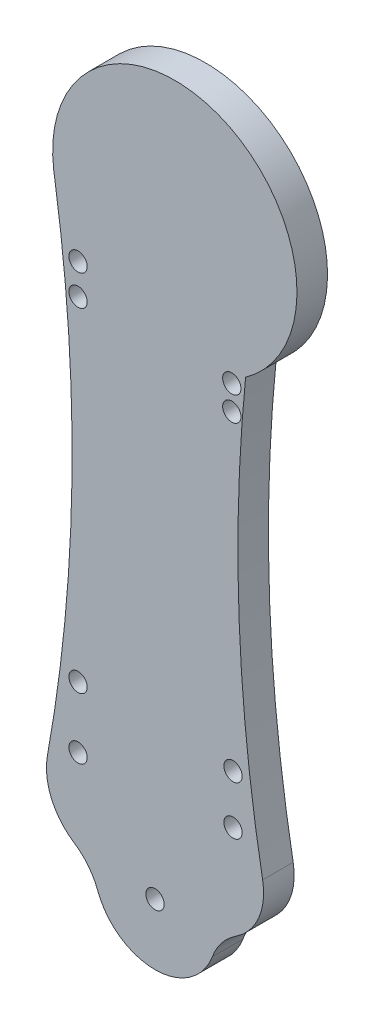
ISO-10303-21;
HEADER;
FILE_DESCRIPTION(('STEP AP214'),'2;1');
FILE_NAME('part.step','',(''),(''),'','','');
FILE_SCHEMA(('AUTOMOTIVE_DESIGN { 1 0 10303 214 1 1 1 1 }'));
ENDSEC;
DATA;
#1=APPLICATION_CONTEXT('core data for automotive mechanical design processes');
#2=APPLICATION_PROTOCOL_DEFINITION('international standard','automotive_design',2000,#1);
#3=PRODUCT_CONTEXT('',#1,'mechanical');
#4=PRODUCT('Part','Part','',(#3));
#5=PRODUCT_RELATED_PRODUCT_CATEGORY('part','',(#4));
#6=PRODUCT_DEFINITION_FORMATION('','',#4);
#7=PRODUCT_DEFINITION_CONTEXT('part definition',#1,'design');
#8=PRODUCT_DEFINITION('design','',#6,#7);
#9=PRODUCT_DEFINITION_SHAPE('','',#8);
#10=(LENGTH_UNIT() NAMED_UNIT(*) SI_UNIT(.MILLI.,.METRE.));
#11=(NAMED_UNIT(*) PLANE_ANGLE_UNIT() SI_UNIT($,.RADIAN.));
#12=(NAMED_UNIT(*) SI_UNIT($,.STERADIAN.) SOLID_ANGLE_UNIT());
#13=UNCERTAINTY_MEASURE_WITH_UNIT(LENGTH_MEASURE(1.E-05),#10,'distance_accuracy_value','');
#14=(GEOMETRIC_REPRESENTATION_CONTEXT(3) GLOBAL_UNCERTAINTY_ASSIGNED_CONTEXT((#13)) GLOBAL_UNIT_ASSIGNED_CONTEXT((#10,
#11,#12)) REPRESENTATION_CONTEXT('',''));
#15=CARTESIAN_POINT('',(0.,0.,0.));
#16=DIRECTION('',(0.,0.,1.));
#17=DIRECTION('',(1.,0.,0.));
#18=AXIS2_PLACEMENT_3D('',#15,#16,#17);
#19=CARTESIAN_POINT('',(263.569146060618,56.3388949776364,5.));
#20=DIRECTION('',(0.,0.,-1.));
#21=DIRECTION('',(-1.,0.,0.));
#22=AXIS2_PLACEMENT_3D('',#19,#20,#21);
#23=CYLINDRICAL_SURFACE('',#22,250.);
#24=CARTESIAN_POINT('',(263.569146060618,56.3388949776364,5.));
#25=DIRECTION('',(0.,0.,1.));
#26=DIRECTION('',(1.,0.,0.));
#27=AXIS2_PLACEMENT_3D('',#24,#25,#26);
#28=CIRCLE('',#27,250.);
#29=CARTESIAN_POINT('',(17.6154614259409,11.5417408869401,5.));
#30=VERTEX_POINT('',#29);
#31=CARTESIAN_POINT('',(14.8299436653512,81.4149630858208,5.));
#32=VERTEX_POINT('',#31);
#33=EDGE_CURVE('E104',#30,#32,#28,.F.);
#34=ORIENTED_EDGE('',*,*,#33,.F.);
#35=DIRECTION('',(0.,0.,-1.));
#36=VECTOR('',#35,1.);
#37=CARTESIAN_POINT('',(17.6154614259408,11.5417408869401,5.));
#38=LINE('',#37,#36);
#39=CARTESIAN_POINT('',(17.6154614259409,11.5417408869401,0.));
#40=VERTEX_POINT('',#39);
#41=EDGE_CURVE('E130',#30,#40,#38,.T.);
#42=ORIENTED_EDGE('',*,*,#41,.T.);
#43=CARTESIAN_POINT('',(263.569146060618,56.3388949776364,0.));
#44=DIRECTION('',(0.,0.,1.));
#45=DIRECTION('',(1.,0.,0.));
#46=AXIS2_PLACEMENT_3D('',#43,#44,#45);
#47=CIRCLE('',#46,250.);
#48=CARTESIAN_POINT('',(14.8299436653512,81.4149630858208,0.));
#49=VERTEX_POINT('',#48);
#50=EDGE_CURVE('E128',#40,#49,#47,.F.);
#51=ORIENTED_EDGE('',*,*,#50,.T.);
#52=DIRECTION('',(0.,0.,-1.));
#53=VECTOR('',#52,1.);
#54=CARTESIAN_POINT('',(14.8299436653512,81.4149630858208,5.));
#55=LINE('',#54,#53);
#56=EDGE_CURVE('E122',#32,#49,#55,.T.);
#57=ORIENTED_EDGE('',*,*,#56,.F.);
#58=EDGE_LOOP('',(#34,#42,#51,#57));
#59=FACE_BOUND('',#58,.T.);
#60=ADVANCED_FACE('F34',(#59),#23,.F.);
#61=CARTESIAN_POINT('',(3.24159201282626,97.7155798219269,5.));
#62=DIRECTION('',(0.,0.,-1.));
#63=DIRECTION('',(-1.,0.,0.));
#64=AXIS2_PLACEMENT_3D('',#61,#62,#63);
#65=CYLINDRICAL_SURFACE('',#64,20.);
#66=CARTESIAN_POINT('',(3.24159201282626,97.7155798219269,0.));
#67=DIRECTION('',(0.,0.,1.));
#68=DIRECTION('',(1.,0.,0.));
#69=AXIS2_PLACEMENT_3D('',#66,#67,#68);
#70=CIRCLE('',#69,20.);
#71=CARTESIAN_POINT('',(-16.5765244711894,95.0244352650541,0.));
#72=VERTEX_POINT('',#71);
#73=EDGE_CURVE('E219',#49,#72,#70,.T.);
#74=ORIENTED_EDGE('',*,*,#73,.T.);
#75=DIRECTION('',(0.,0.,-1.));
#76=VECTOR('',#75,1.);
#77=CARTESIAN_POINT('',(-16.5765244711894,95.0244352650541,5.));
#78=LINE('',#77,#76);
#79=CARTESIAN_POINT('',(-16.5765244711894,95.0244352650541,5.));
#80=VERTEX_POINT('',#79);
#81=EDGE_CURVE('E123',#80,#72,#78,.T.);
#82=ORIENTED_EDGE('',*,*,#81,.F.);
#83=CARTESIAN_POINT('',(3.24159201282626,97.7155798219269,5.));
#84=DIRECTION('',(0.,0.,1.));
#85=DIRECTION('',(1.,0.,0.));
#86=AXIS2_PLACEMENT_3D('',#83,#84,#85);
#87=CIRCLE('',#86,20.);
#88=EDGE_CURVE('E109',#32,#80,#87,.T.);
#89=ORIENTED_EDGE('',*,*,#88,.F.);
#90=ORIENTED_EDGE('',*,*,#56,.T.);
#91=EDGE_LOOP('',(#74,#82,#89,#90));
#92=FACE_BOUND('',#91,.T.);
#93=ADVANCED_FACE('F121',(#92),#65,.T.);
#94=CARTESIAN_POINT('',(-2.18344410291627,-0.329576970241774,5.));
#95=DIRECTION('',(-0.98879905314421,-0.149252914548141,0.));
#96=DIRECTION('',(0.149252914548141,-0.98879905314421,0.));
#97=AXIS2_PLACEMENT_3D('',#94,#95,#96);
#98=PLANE('',#97);
#99=DIRECTION('',(-0.149252914548141,0.98879905314421,0.));
#100=VECTOR('',#99,1.);
#101=CARTESIAN_POINT('',(-2.18344410291627,-0.329576970241774,0.));
#102=LINE('',#101,#100);
#103=CARTESIAN_POINT('',(-16.369382774566,93.6521236146717,0.));
#104=VERTEX_POINT('',#103);
#105=EDGE_CURVE('E221',#104,#72,#102,.T.);
#106=ORIENTED_EDGE('',*,*,#105,.F.);
#107=DIRECTION('',(0.,0.,-1.));
#108=VECTOR('',#107,1.);
#109=CARTESIAN_POINT('',(-16.369382774566,93.6521236146717,5.));
#110=LINE('',#109,#108);
#111=CARTESIAN_POINT('',(-16.369382774566,93.6521236146717,5.));
#112=VERTEX_POINT('',#111);
#113=EDGE_CURVE('E134',#112,#104,#110,.T.);
#114=ORIENTED_EDGE('',*,*,#113,.F.);
#115=DIRECTION('',(-0.149252914548141,0.98879905314421,0.));
#116=VECTOR('',#115,1.);
#117=CARTESIAN_POINT('',(-2.18344410291627,-0.329576970241774,5.));
#118=LINE('',#117,#116);
#119=EDGE_CURVE('E125',#112,#80,#118,.T.);
#120=ORIENTED_EDGE('',*,*,#119,.T.);
#121=ORIENTED_EDGE('',*,*,#81,.T.);
#122=EDGE_LOOP('',(#106,#114,#120,#121));
#123=FACE_BOUND('',#122,.T.);
#124=ADVANCED_FACE('F236',(#123),#98,.T.);
#125=CARTESIAN_POINT('',(-263.569146060618,56.3388949776364,5.));
#126=DIRECTION('',(0.,0.,-1.));
#127=DIRECTION('',(-1.,0.,0.));
#128=AXIS2_PLACEMENT_3D('',#125,#126,#127);
#129=CYLINDRICAL_SURFACE('',#128,250.);
#130=CARTESIAN_POINT('',(-263.569146060618,56.3388949776364,0.));
#131=DIRECTION('',(0.,0.,1.));
#132=DIRECTION('',(1.,0.,0.));
#133=AXIS2_PLACEMENT_3D('',#130,#131,#132);
#134=CIRCLE('',#133,250.);
#135=CARTESIAN_POINT('',(-17.6154614259409,11.5417408869394,0.));
#136=VERTEX_POINT('',#135);
#137=EDGE_CURVE('E224',#136,#104,#134,.T.);
#138=ORIENTED_EDGE('',*,*,#137,.F.);
#139=DIRECTION('',(0.,0.,-1.));
#140=VECTOR('',#139,1.);
#141=CARTESIAN_POINT('',(-17.6154614259409,11.5417408869394,5.));
#142=LINE('',#141,#140);
#143=CARTESIAN_POINT('',(-17.615461425941,11.5417408869395,5.));
#144=VERTEX_POINT('',#143);
#145=EDGE_CURVE('E145',#136,#144,#142,.F.);
#146=ORIENTED_EDGE('',*,*,#145,.T.);
#147=CARTESIAN_POINT('',(-263.569146060618,56.3388949776364,5.));
#148=DIRECTION('',(0.,0.,1.));
#149=DIRECTION('',(1.,0.,0.));
#150=AXIS2_PLACEMENT_3D('',#147,#148,#149);
#151=CIRCLE('',#150,250.);
#152=EDGE_CURVE('E214',#144,#112,#151,.T.);
#153=ORIENTED_EDGE('',*,*,#152,.T.);
#154=ORIENTED_EDGE('',*,*,#113,.T.);
#155=EDGE_LOOP('',(#138,#146,#153,#154));
#156=FACE_BOUND('',#155,.T.);
#157=ADVANCED_FACE('F232',(#156),#129,.F.);
#158=CARTESIAN_POINT('',(0.,0.,5.));
#159=DIRECTION('',(0.,0.,-1.));
#160=DIRECTION('',(-1.,0.,0.));
#161=AXIS2_PLACEMENT_3D('',#158,#159,#160);
#162=CYLINDRICAL_SURFACE('',#161,10.);
#163=CARTESIAN_POINT('',(0.,0.,5.));
#164=DIRECTION('',(0.,0.,1.));
#165=DIRECTION('',(1.,0.,0.));
#166=AXIS2_PLACEMENT_3D('',#163,#164,#165);
#167=CIRCLE('',#166,10.);
#168=CARTESIAN_POINT('',(-9.37212768633296,-3.48758120064195,5.));
#169=VERTEX_POINT('',#168);
#170=CARTESIAN_POINT('',(9.37212768633315,-3.48758120064144,5.));
#171=VERTEX_POINT('',#170);
#172=EDGE_CURVE('E216',#169,#171,#167,.T.);
#173=ORIENTED_EDGE('',*,*,#172,.F.);
#174=DIRECTION('',(0.,0.,-1.));
#175=VECTOR('',#174,1.);
#176=CARTESIAN_POINT('',(-9.37212768633296,-3.48758120064195,5.));
#177=LINE('',#176,#175);
#178=CARTESIAN_POINT('',(-9.37212768633296,-3.48758120064195,0.));
#179=VERTEX_POINT('',#178);
#180=EDGE_CURVE('E149',#169,#179,#177,.T.);
#181=ORIENTED_EDGE('',*,*,#180,.T.);
#182=CARTESIAN_POINT('',(0.,0.,0.));
#183=DIRECTION('',(0.,0.,1.));
#184=DIRECTION('',(1.,0.,0.));
#185=AXIS2_PLACEMENT_3D('',#182,#183,#184);
#186=CIRCLE('',#185,10.);
#187=CARTESIAN_POINT('',(9.37212768633315,-3.48758120064144,0.));
#188=VERTEX_POINT('',#187);
#189=EDGE_CURVE('E116',#179,#188,#186,.T.);
#190=ORIENTED_EDGE('',*,*,#189,.T.);
#191=DIRECTION('',(0.,0.,-1.));
#192=VECTOR('',#191,1.);
#193=CARTESIAN_POINT('',(9.37212768633315,-3.48758120064144,5.));
#194=LINE('',#193,#192);
#195=EDGE_CURVE('E147',#188,#171,#194,.F.);
#196=ORIENTED_EDGE('',*,*,#195,.T.);
#197=EDGE_LOOP('',(#173,#181,#190,#196));
#198=FACE_BOUND('',#197,.T.);
#199=ADVANCED_FACE('F251',(#198),#162,.T.);
#200=CARTESIAN_POINT('',(0.,0.,5.));
#201=DIRECTION('',(0.,0.,1.));
#202=DIRECTION('',(1.,0.,0.));
#203=AXIS2_PLACEMENT_3D('',#200,#201,#202);
#204=PLANE('',#203);
#205=CARTESIAN_POINT('',(12.57,75.41,5.));
#206=DIRECTION('',(0.,0.,1.));
#207=DIRECTION('',(1.,0.,0.));
#208=AXIS2_PLACEMENT_3D('',#205,#206,#207);
#209=CIRCLE('',#208,1.5);
#210=CARTESIAN_POINT('',(14.07,75.41,5.));
#211=VERTEX_POINT('',#210);
#212=EDGE_CURVE('E169',#211,#211,#209,.T.);
#213=ORIENTED_EDGE('',*,*,#212,.F.);
#214=EDGE_LOOP('',(#213));
#215=FACE_BOUND('',#214,.T.);
#216=CARTESIAN_POINT('',(12.77,24.54,5.));
#217=DIRECTION('',(0.,0.,1.));
#218=DIRECTION('',(1.,0.,0.));
#219=AXIS2_PLACEMENT_3D('',#216,#217,#218);
#220=CIRCLE('',#219,1.5);
#221=CARTESIAN_POINT('',(14.27,24.54,5.));
#222=VERTEX_POINT('',#221);
#223=EDGE_CURVE('E317',#222,#222,#220,.T.);
#224=ORIENTED_EDGE('',*,*,#223,.F.);
#225=EDGE_LOOP('',(#224));
#226=FACE_BOUND('',#225,.T.);
#227=CARTESIAN_POINT('',(12.77,16.54,5.));
#228=DIRECTION('',(0.,0.,1.));
#229=DIRECTION('',(1.,0.,0.));
#230=AXIS2_PLACEMENT_3D('',#227,#228,#229);
#231=CIRCLE('',#230,1.5);
#232=CARTESIAN_POINT('',(14.27,16.54,5.));
#233=VERTEX_POINT('',#232);
#234=EDGE_CURVE('E182',#233,#233,#231,.T.);
#235=ORIENTED_EDGE('',*,*,#234,.F.);
#236=EDGE_LOOP('',(#235));
#237=FACE_BOUND('',#236,.T.);
#238=CARTESIAN_POINT('',(12.57,79.41,5.));
#239=DIRECTION('',(0.,0.,1.));
#240=DIRECTION('',(1.,0.,0.));
#241=AXIS2_PLACEMENT_3D('',#238,#239,#240);
#242=CIRCLE('',#241,1.5);
#243=CARTESIAN_POINT('',(14.07,79.41,5.));
#244=VERTEX_POINT('',#243);
#245=EDGE_CURVE('E165',#244,#244,#242,.T.);
#246=ORIENTED_EDGE('',*,*,#245,.F.);
#247=EDGE_LOOP('',(#246));
#248=FACE_BOUND('',#247,.T.);
#249=CARTESIAN_POINT('',(-12.6,24.5,5.));
#250=DIRECTION('',(0.,0.,1.));
#251=DIRECTION('',(1.,0.,0.));
#252=AXIS2_PLACEMENT_3D('',#249,#250,#251);
#253=CIRCLE('',#252,1.5);
#254=CARTESIAN_POINT('',(-11.1,24.5,5.));
#255=VERTEX_POINT('',#254);
#256=EDGE_CURVE('E188',#255,#255,#253,.T.);
#257=ORIENTED_EDGE('',*,*,#256,.F.);
#258=EDGE_LOOP('',(#257));
#259=FACE_BOUND('',#258,.T.);
#260=CARTESIAN_POINT('',(-12.6,79.11,5.));
#261=DIRECTION('',(0.,0.,1.));
#262=DIRECTION('',(1.,0.,0.));
#263=AXIS2_PLACEMENT_3D('',#260,#261,#262);
#264=CIRCLE('',#263,1.5);
#265=CARTESIAN_POINT('',(-11.1,79.11,5.));
#266=VERTEX_POINT('',#265);
#267=EDGE_CURVE('E194',#266,#266,#264,.T.);
#268=ORIENTED_EDGE('',*,*,#267,.F.);
#269=EDGE_LOOP('',(#268));
#270=FACE_BOUND('',#269,.T.);
#271=CARTESIAN_POINT('',(-12.6,84.11,5.));
#272=DIRECTION('',(0.,0.,1.));
#273=DIRECTION('',(1.,0.,0.));
#274=AXIS2_PLACEMENT_3D('',#271,#272,#273);
#275=CIRCLE('',#274,1.5);
#276=CARTESIAN_POINT('',(-11.1,84.11,5.));
#277=VERTEX_POINT('',#276);
#278=EDGE_CURVE('E164',#277,#277,#275,.T.);
#279=ORIENTED_EDGE('',*,*,#278,.F.);
#280=EDGE_LOOP('',(#279));
#281=FACE_BOUND('',#280,.T.);
#282=CARTESIAN_POINT('',(-12.6,14.5,5.));
#283=DIRECTION('',(0.,0.,1.));
#284=DIRECTION('',(1.,0.,0.));
#285=AXIS2_PLACEMENT_3D('',#282,#283,#284);
#286=CIRCLE('',#285,1.5);
#287=CARTESIAN_POINT('',(-11.1,14.5,5.));
#288=VERTEX_POINT('',#287);
#289=EDGE_CURVE('E187',#288,#288,#286,.T.);
#290=ORIENTED_EDGE('',*,*,#289,.F.);
#291=EDGE_LOOP('',(#290));
#292=FACE_BOUND('',#291,.T.);
#293=CARTESIAN_POINT('',(0.,0.,5.));
#294=DIRECTION('',(0.,0.,1.));
#295=DIRECTION('',(1.,0.,0.));
#296=AXIS2_PLACEMENT_3D('',#293,#294,#295);
#297=CIRCLE('',#296,1.5);
#298=CARTESIAN_POINT('',(1.5,0.,5.));
#299=VERTEX_POINT('',#298);
#300=EDGE_CURVE('E205',#299,#299,#297,.T.);
#301=ORIENTED_EDGE('',*,*,#300,.F.);
#302=EDGE_LOOP('',(#301));
#303=FACE_BOUND('',#302,.T.);
#304=CARTESIAN_POINT('',(-7.77731404055385,9.74985472331157,5.));
#305=DIRECTION('',(0.,0.,1.));
#306=DIRECTION('',(1.,0.,0.));
#307=AXIS2_PLACEMENT_3D('',#304,#305,#306);
#308=CIRCLE('',#307,10.);
#309=CARTESIAN_POINT('',(-13.2607847066099,1.38734616101384,5.));
#310=VERTEX_POINT('',#309);
#311=EDGE_CURVE('E142',#144,#310,#308,.T.);
#312=ORIENTED_EDGE('',*,*,#311,.T.);
#313=CARTESIAN_POINT('',(-18.7442553726659,-6.9751624012839,5.));
#314=DIRECTION('',(0.,0.,1.));
#315=DIRECTION('',(1.,0.,0.));
#316=AXIS2_PLACEMENT_3D('',#313,#314,#315);
#317=CIRCLE('',#316,10.);
#318=EDGE_CURVE('E158',#310,#169,#317,.F.);
#319=ORIENTED_EDGE('',*,*,#318,.T.);
#320=ORIENTED_EDGE('',*,*,#172,.T.);
#321=CARTESIAN_POINT('',(18.7442553726663,-6.97516240128287,5.));
#322=DIRECTION('',(0.,0.,1.));
#323=DIRECTION('',(1.,0.,0.));
#324=AXIS2_PLACEMENT_3D('',#321,#322,#323);
#325=CIRCLE('',#324,10.);
#326=CARTESIAN_POINT('',(13.26078470661,1.3873461610147,5.));
#327=VERTEX_POINT('',#326);
#328=EDGE_CURVE('E11',#171,#327,#325,.F.);
#329=ORIENTED_EDGE('',*,*,#328,.T.);
#330=CARTESIAN_POINT('',(7.77731404055373,9.74985472331227,5.));
#331=DIRECTION('',(0.,0.,1.));
#332=DIRECTION('',(1.,0.,0.));
#333=AXIS2_PLACEMENT_3D('',#330,#331,#332);
#334=CIRCLE('',#333,10.);
#335=EDGE_CURVE('E111',#327,#30,#334,.T.);
#336=ORIENTED_EDGE('',*,*,#335,.T.);
#337=ORIENTED_EDGE('',*,*,#33,.T.);
#338=ORIENTED_EDGE('',*,*,#88,.T.);
#339=ORIENTED_EDGE('',*,*,#119,.F.);
#340=ORIENTED_EDGE('',*,*,#152,.F.);
#341=EDGE_LOOP('',(#312,#319,#320,#329,#336,#337,#338,#339,#340));
#342=FACE_BOUND('',#341,.T.);
#343=ADVANCED_FACE('F107',(#215,#226,#237,#248,#259,#270,#281,#292,#303,#342),#204,.T.);
#344=CARTESIAN_POINT('',(0.,0.,0.));
#345=DIRECTION('',(0.,0.,1.));
#346=DIRECTION('',(1.,0.,0.));
#347=AXIS2_PLACEMENT_3D('',#344,#345,#346);
#348=PLANE('',#347);
#349=CARTESIAN_POINT('',(12.57,75.41,0.));
#350=DIRECTION('',(0.,0.,1.));
#351=DIRECTION('',(1.,0.,0.));
#352=AXIS2_PLACEMENT_3D('',#349,#350,#351);
#353=CIRCLE('',#352,1.5);
#354=CARTESIAN_POINT('',(14.07,75.41,0.));
#355=VERTEX_POINT('',#354);
#356=EDGE_CURVE('E38',#355,#355,#353,.T.);
#357=ORIENTED_EDGE('',*,*,#356,.T.);
#358=EDGE_LOOP('',(#357));
#359=FACE_BOUND('',#358,.T.);
#360=CARTESIAN_POINT('',(12.77,24.54,0.));
#361=DIRECTION('',(0.,0.,1.));
#362=DIRECTION('',(1.,0.,0.));
#363=AXIS2_PLACEMENT_3D('',#360,#361,#362);
#364=CIRCLE('',#363,1.5);
#365=CARTESIAN_POINT('',(14.27,24.54,0.));
#366=VERTEX_POINT('',#365);
#367=EDGE_CURVE('E168',#366,#366,#364,.T.);
#368=ORIENTED_EDGE('',*,*,#367,.T.);
#369=EDGE_LOOP('',(#368));
#370=FACE_BOUND('',#369,.T.);
#371=CARTESIAN_POINT('',(12.77,16.54,0.));
#372=DIRECTION('',(0.,0.,1.));
#373=DIRECTION('',(1.,0.,0.));
#374=AXIS2_PLACEMENT_3D('',#371,#372,#373);
#375=CIRCLE('',#374,1.5);
#376=CARTESIAN_POINT('',(14.27,16.54,0.));
#377=VERTEX_POINT('',#376);
#378=EDGE_CURVE('E166',#377,#377,#375,.T.);
#379=ORIENTED_EDGE('',*,*,#378,.T.);
#380=EDGE_LOOP('',(#379));
#381=FACE_BOUND('',#380,.T.);
#382=CARTESIAN_POINT('',(12.57,79.41,0.));
#383=DIRECTION('',(0.,0.,1.));
#384=DIRECTION('',(1.,0.,0.));
#385=AXIS2_PLACEMENT_3D('',#382,#383,#384);
#386=CIRCLE('',#385,1.5);
#387=CARTESIAN_POINT('',(14.07,79.41,0.));
#388=VERTEX_POINT('',#387);
#389=EDGE_CURVE('E161',#388,#388,#386,.T.);
#390=ORIENTED_EDGE('',*,*,#389,.T.);
#391=EDGE_LOOP('',(#390));
#392=FACE_BOUND('',#391,.T.);
#393=CARTESIAN_POINT('',(-12.6,24.5,0.));
#394=DIRECTION('',(0.,0.,1.));
#395=DIRECTION('',(1.,0.,0.));
#396=AXIS2_PLACEMENT_3D('',#393,#394,#395);
#397=CIRCLE('',#396,1.5);
#398=CARTESIAN_POINT('',(-11.1,24.5,0.));
#399=VERTEX_POINT('',#398);
#400=EDGE_CURVE('E184',#399,#399,#397,.T.);
#401=ORIENTED_EDGE('',*,*,#400,.T.);
#402=EDGE_LOOP('',(#401));
#403=FACE_BOUND('',#402,.T.);
#404=CARTESIAN_POINT('',(-12.6,79.11,0.));
#405=DIRECTION('',(0.,0.,1.));
#406=DIRECTION('',(1.,0.,0.));
#407=AXIS2_PLACEMENT_3D('',#404,#405,#406);
#408=CIRCLE('',#407,1.5);
#409=CARTESIAN_POINT('',(-11.1,79.11,0.));
#410=VERTEX_POINT('',#409);
#411=EDGE_CURVE('E191',#410,#410,#408,.T.);
#412=ORIENTED_EDGE('',*,*,#411,.T.);
#413=EDGE_LOOP('',(#412));
#414=FACE_BOUND('',#413,.T.);
#415=CARTESIAN_POINT('',(-12.6,84.11,0.));
#416=DIRECTION('',(0.,0.,1.));
#417=DIRECTION('',(1.,0.,0.));
#418=AXIS2_PLACEMENT_3D('',#415,#416,#417);
#419=CIRCLE('',#418,1.5);
#420=CARTESIAN_POINT('',(-11.1,84.11,0.));
#421=VERTEX_POINT('',#420);
#422=EDGE_CURVE('E197',#421,#421,#419,.T.);
#423=ORIENTED_EDGE('',*,*,#422,.T.);
#424=EDGE_LOOP('',(#423));
#425=FACE_BOUND('',#424,.T.);
#426=CARTESIAN_POINT('',(-12.6,14.5,0.));
#427=DIRECTION('',(0.,0.,1.));
#428=DIRECTION('',(1.,0.,0.));
#429=AXIS2_PLACEMENT_3D('',#426,#427,#428);
#430=CIRCLE('',#429,1.5);
#431=CARTESIAN_POINT('',(-11.1,14.5,0.));
#432=VERTEX_POINT('',#431);
#433=EDGE_CURVE('E202',#432,#432,#430,.T.);
#434=ORIENTED_EDGE('',*,*,#433,.T.);
#435=EDGE_LOOP('',(#434));
#436=FACE_BOUND('',#435,.T.);
#437=CARTESIAN_POINT('',(0.,0.,0.));
#438=DIRECTION('',(0.,0.,1.));
#439=DIRECTION('',(1.,0.,0.));
#440=AXIS2_PLACEMENT_3D('',#437,#438,#439);
#441=CIRCLE('',#440,1.5);
#442=CARTESIAN_POINT('',(1.5,0.,0.));
#443=VERTEX_POINT('',#442);
#444=EDGE_CURVE('E208',#443,#443,#441,.T.);
#445=ORIENTED_EDGE('',*,*,#444,.T.);
#446=EDGE_LOOP('',(#445));
#447=FACE_BOUND('',#446,.T.);
#448=ORIENTED_EDGE('',*,*,#50,.F.);
#449=CARTESIAN_POINT('',(7.77731404055373,9.74985472331227,0.));
#450=DIRECTION('',(0.,0.,1.));
#451=DIRECTION('',(1.,0.,0.));
#452=AXIS2_PLACEMENT_3D('',#449,#450,#451);
#453=CIRCLE('',#452,10.);
#454=CARTESIAN_POINT('',(13.26078470661,1.3873461610147,0.));
#455=VERTEX_POINT('',#454);
#456=EDGE_CURVE('E139',#40,#455,#453,.F.);
#457=ORIENTED_EDGE('',*,*,#456,.T.);
#458=CARTESIAN_POINT('',(18.7442553726663,-6.97516240128287,0.));
#459=DIRECTION('',(0.,0.,1.));
#460=DIRECTION('',(1.,0.,0.));
#461=AXIS2_PLACEMENT_3D('',#458,#459,#460);
#462=CIRCLE('',#461,10.);
#463=EDGE_CURVE('E43',#455,#188,#462,.T.);
#464=ORIENTED_EDGE('',*,*,#463,.T.);
#465=ORIENTED_EDGE('',*,*,#189,.F.);
#466=CARTESIAN_POINT('',(-18.7442553726659,-6.9751624012839,0.));
#467=DIRECTION('',(0.,0.,1.));
#468=DIRECTION('',(1.,0.,0.));
#469=AXIS2_PLACEMENT_3D('',#466,#467,#468);
#470=CIRCLE('',#469,10.);
#471=CARTESIAN_POINT('',(-13.2607847066099,1.38734616101384,0.));
#472=VERTEX_POINT('',#471);
#473=EDGE_CURVE('E156',#179,#472,#470,.T.);
#474=ORIENTED_EDGE('',*,*,#473,.T.);
#475=CARTESIAN_POINT('',(-7.77731404055385,9.74985472331157,0.));
#476=DIRECTION('',(0.,0.,1.));
#477=DIRECTION('',(1.,0.,0.));
#478=AXIS2_PLACEMENT_3D('',#475,#476,#477);
#479=CIRCLE('',#478,10.);
#480=EDGE_CURVE('E132',#472,#136,#479,.F.);
#481=ORIENTED_EDGE('',*,*,#480,.T.);
#482=ORIENTED_EDGE('',*,*,#137,.T.);
#483=ORIENTED_EDGE('',*,*,#105,.T.);
#484=ORIENTED_EDGE('',*,*,#73,.F.);
#485=EDGE_LOOP('',(#448,#457,#464,#465,#474,#481,#482,#483,#484));
#486=FACE_BOUND('',#485,.T.);
#487=ADVANCED_FACE('F238',(#359,#370,#381,#392,#403,#414,#425,#436,#447,#486),#348,.F.);
#488=CARTESIAN_POINT('',(7.77731404055373,9.74985472331227,5.));
#489=DIRECTION('',(0.,0.,-1.));
#490=DIRECTION('',(-1.,0.,0.));
#491=AXIS2_PLACEMENT_3D('',#488,#489,#490);
#492=CYLINDRICAL_SURFACE('',#491,10.);
#493=ORIENTED_EDGE('',*,*,#335,.F.);
#494=DIRECTION('',(0.,0.,-1.));
#495=VECTOR('',#494,1.);
#496=CARTESIAN_POINT('',(13.26078470661,1.3873461610147,5.));
#497=LINE('',#496,#495);
#498=EDGE_CURVE('E154',#327,#455,#497,.T.);
#499=ORIENTED_EDGE('',*,*,#498,.T.);
#500=ORIENTED_EDGE('',*,*,#456,.F.);
#501=ORIENTED_EDGE('',*,*,#41,.F.);
#502=EDGE_LOOP('',(#493,#499,#500,#501));
#503=FACE_BOUND('',#502,.T.);
#504=ADVANCED_FACE('F253',(#503),#492,.T.);
#505=CARTESIAN_POINT('',(-7.77731404055385,9.74985472331157,5.));
#506=DIRECTION('',(0.,0.,-1.));
#507=DIRECTION('',(-1.,0.,0.));
#508=AXIS2_PLACEMENT_3D('',#505,#506,#507);
#509=CYLINDRICAL_SURFACE('',#508,10.);
#510=ORIENTED_EDGE('',*,*,#480,.F.);
#511=DIRECTION('',(0.,0.,-1.));
#512=VECTOR('',#511,1.);
#513=CARTESIAN_POINT('',(-13.2607847066099,1.38734616101384,5.));
#514=LINE('',#513,#512);
#515=EDGE_CURVE('E152',#472,#310,#514,.F.);
#516=ORIENTED_EDGE('',*,*,#515,.T.);
#517=ORIENTED_EDGE('',*,*,#311,.F.);
#518=ORIENTED_EDGE('',*,*,#145,.F.);
#519=EDGE_LOOP('',(#510,#516,#517,#518));
#520=FACE_BOUND('',#519,.T.);
#521=ADVANCED_FACE('F243',(#520),#509,.T.);
#522=CARTESIAN_POINT('',(-18.7442553726659,-6.9751624012839,5.));
#523=DIRECTION('',(0.,0.,1.));
#524=DIRECTION('',(1.,0.,0.));
#525=AXIS2_PLACEMENT_3D('',#522,#523,#524);
#526=CYLINDRICAL_SURFACE('',#525,10.);
#527=ORIENTED_EDGE('',*,*,#318,.F.);
#528=ORIENTED_EDGE('',*,*,#515,.F.);
#529=ORIENTED_EDGE('',*,*,#473,.F.);
#530=ORIENTED_EDGE('',*,*,#180,.F.);
#531=EDGE_LOOP('',(#527,#528,#529,#530));
#532=FACE_BOUND('',#531,.T.);
#533=ADVANCED_FACE('F247',(#532),#526,.F.);
#534=CARTESIAN_POINT('',(18.7442553726663,-6.97516240128287,5.));
#535=DIRECTION('',(0.,0.,1.));
#536=DIRECTION('',(1.,0.,0.));
#537=AXIS2_PLACEMENT_3D('',#534,#535,#536);
#538=CYLINDRICAL_SURFACE('',#537,10.);
#539=ORIENTED_EDGE('',*,*,#328,.F.);
#540=ORIENTED_EDGE('',*,*,#195,.F.);
#541=ORIENTED_EDGE('',*,*,#463,.F.);
#542=ORIENTED_EDGE('',*,*,#498,.F.);
#543=EDGE_LOOP('',(#539,#540,#541,#542));
#544=FACE_BOUND('',#543,.T.);
#545=ADVANCED_FACE('F36',(#544),#538,.F.);
#546=CARTESIAN_POINT('',(0.,0.,0.));
#547=DIRECTION('',(0.,0.,1.));
#548=DIRECTION('',(1.,0.,0.));
#549=AXIS2_PLACEMENT_3D('',#546,#547,#548);
#550=CYLINDRICAL_SURFACE('',#549,1.5);
#551=ORIENTED_EDGE('',*,*,#444,.F.);
#552=EDGE_LOOP('',(#551));
#553=FACE_BOUND('',#552,.T.);
#554=ORIENTED_EDGE('',*,*,#300,.T.);
#555=EDGE_LOOP('',(#554));
#556=FACE_BOUND('',#555,.T.);
#557=ADVANCED_FACE('F278',(#553,#556),#550,.F.);
#558=CARTESIAN_POINT('',(-12.6,14.5,0.));
#559=DIRECTION('',(0.,0.,1.));
#560=DIRECTION('',(1.,0.,0.));
#561=AXIS2_PLACEMENT_3D('',#558,#559,#560);
#562=CYLINDRICAL_SURFACE('',#561,1.5);
#563=ORIENTED_EDGE('',*,*,#433,.F.);
#564=EDGE_LOOP('',(#563));
#565=FACE_BOUND('',#564,.T.);
#566=ORIENTED_EDGE('',*,*,#289,.T.);
#567=EDGE_LOOP('',(#566));
#568=FACE_BOUND('',#567,.T.);
#569=ADVANCED_FACE('F281',(#565,#568),#562,.F.);
#570=CARTESIAN_POINT('',(-12.6,84.11,0.));
#571=DIRECTION('',(0.,0.,1.));
#572=DIRECTION('',(1.,0.,0.));
#573=AXIS2_PLACEMENT_3D('',#570,#571,#572);
#574=CYLINDRICAL_SURFACE('',#573,1.5);
#575=ORIENTED_EDGE('',*,*,#422,.F.);
#576=EDGE_LOOP('',(#575));
#577=FACE_BOUND('',#576,.T.);
#578=ORIENTED_EDGE('',*,*,#278,.T.);
#579=EDGE_LOOP('',(#578));
#580=FACE_BOUND('',#579,.T.);
#581=ADVANCED_FACE('F285',(#577,#580),#574,.F.);
#582=CARTESIAN_POINT('',(-12.6,79.11,0.));
#583=DIRECTION('',(0.,0.,1.));
#584=DIRECTION('',(1.,0.,0.));
#585=AXIS2_PLACEMENT_3D('',#582,#583,#584);
#586=CYLINDRICAL_SURFACE('',#585,1.5);
#587=ORIENTED_EDGE('',*,*,#411,.F.);
#588=EDGE_LOOP('',(#587));
#589=FACE_BOUND('',#588,.T.);
#590=ORIENTED_EDGE('',*,*,#267,.T.);
#591=EDGE_LOOP('',(#590));
#592=FACE_BOUND('',#591,.T.);
#593=ADVANCED_FACE('F289',(#589,#592),#586,.F.);
#594=CARTESIAN_POINT('',(-12.6,24.5,0.));
#595=DIRECTION('',(0.,0.,1.));
#596=DIRECTION('',(1.,0.,0.));
#597=AXIS2_PLACEMENT_3D('',#594,#595,#596);
#598=CYLINDRICAL_SURFACE('',#597,1.5);
#599=ORIENTED_EDGE('',*,*,#400,.F.);
#600=EDGE_LOOP('',(#599));
#601=FACE_BOUND('',#600,.T.);
#602=ORIENTED_EDGE('',*,*,#256,.T.);
#603=EDGE_LOOP('',(#602));
#604=FACE_BOUND('',#603,.T.);
#605=ADVANCED_FACE('F293',(#601,#604),#598,.F.);
#606=CARTESIAN_POINT('',(12.57,79.41,-5.));
#607=DIRECTION('',(0.,0.,1.));
#608=DIRECTION('',(1.,0.,0.));
#609=AXIS2_PLACEMENT_3D('',#606,#607,#608);
#610=CYLINDRICAL_SURFACE('',#609,1.5);
#611=ORIENTED_EDGE('',*,*,#245,.T.);
#612=EDGE_LOOP('',(#611));
#613=FACE_BOUND('',#612,.T.);
#614=ORIENTED_EDGE('',*,*,#389,.F.);
#615=EDGE_LOOP('',(#614));
#616=FACE_BOUND('',#615,.T.);
#617=ADVANCED_FACE('F297',(#613,#616),#610,.F.);
#618=CARTESIAN_POINT('',(12.77,16.54,-5.));
#619=DIRECTION('',(0.,0.,1.));
#620=DIRECTION('',(1.,0.,0.));
#621=AXIS2_PLACEMENT_3D('',#618,#619,#620);
#622=CYLINDRICAL_SURFACE('',#621,1.5);
#623=ORIENTED_EDGE('',*,*,#234,.T.);
#624=EDGE_LOOP('',(#623));
#625=FACE_BOUND('',#624,.T.);
#626=ORIENTED_EDGE('',*,*,#378,.F.);
#627=EDGE_LOOP('',(#626));
#628=FACE_BOUND('',#627,.T.);
#629=ADVANCED_FACE('F301',(#625,#628),#622,.F.);
#630=CARTESIAN_POINT('',(12.77,24.54,-5.));
#631=DIRECTION('',(0.,0.,1.));
#632=DIRECTION('',(1.,0.,0.));
#633=AXIS2_PLACEMENT_3D('',#630,#631,#632);
#634=CYLINDRICAL_SURFACE('',#633,1.5);
#635=ORIENTED_EDGE('',*,*,#223,.T.);
#636=EDGE_LOOP('',(#635));
#637=FACE_BOUND('',#636,.T.);
#638=ORIENTED_EDGE('',*,*,#367,.F.);
#639=EDGE_LOOP('',(#638));
#640=FACE_BOUND('',#639,.T.);
#641=ADVANCED_FACE('F304',(#637,#640),#634,.F.);
#642=CARTESIAN_POINT('',(12.57,75.41,-5.));
#643=DIRECTION('',(0.,0.,1.));
#644=DIRECTION('',(1.,0.,0.));
#645=AXIS2_PLACEMENT_3D('',#642,#643,#644);
#646=CYLINDRICAL_SURFACE('',#645,1.5);
#647=ORIENTED_EDGE('',*,*,#212,.T.);
#648=EDGE_LOOP('',(#647));
#649=FACE_BOUND('',#648,.T.);
#650=ORIENTED_EDGE('',*,*,#356,.F.);
#651=EDGE_LOOP('',(#650));
#652=FACE_BOUND('',#651,.T.);
#653=ADVANCED_FACE('F308',(#649,#652),#646,.F.);
#654=CLOSED_SHELL('',(#60,#93,#124,#157,#199,#343,#487,#504,#521,#533,#545,#557,#569,#581,#593,
#605,#617,#629,#641,#653));
#655=MANIFOLD_SOLID_BREP('B2',#654);
#656=ADVANCED_BREP_SHAPE_REPRESENTATION('',(#18,#655),#14);
#657=SHAPE_DEFINITION_REPRESENTATION(#9,#656);
ENDSEC;
END-ISO-10303-21;
